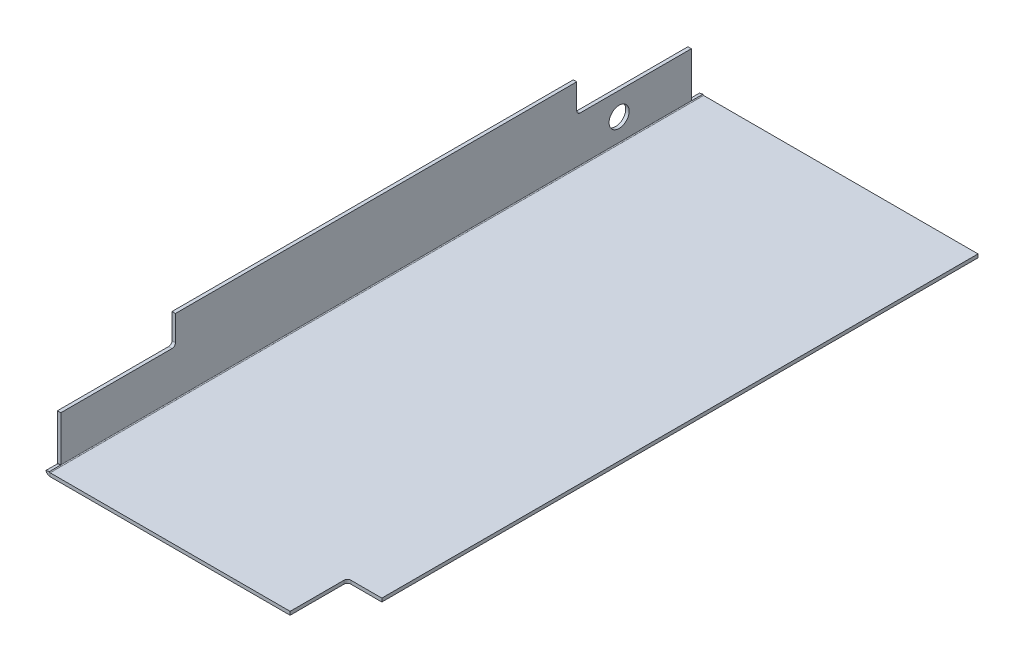
ISO-10303-21;
HEADER;
FILE_DESCRIPTION(('STEP AP214'),'2;1');
FILE_NAME('part.step','',(''),(''),'','','');
FILE_SCHEMA(('AUTOMOTIVE_DESIGN { 1 0 10303 214 1 1 1 1 }'));
ENDSEC;
DATA;
#1=APPLICATION_CONTEXT('core data for automotive mechanical design processes');
#2=APPLICATION_PROTOCOL_DEFINITION('international standard','automotive_design',2000,#1);
#3=PRODUCT_CONTEXT('',#1,'mechanical');
#4=PRODUCT('Part','Part','',(#3));
#5=PRODUCT_RELATED_PRODUCT_CATEGORY('part','',(#4));
#6=PRODUCT_DEFINITION_FORMATION('','',#4);
#7=PRODUCT_DEFINITION_CONTEXT('part definition',#1,'design');
#8=PRODUCT_DEFINITION('design','',#6,#7);
#9=PRODUCT_DEFINITION_SHAPE('','',#8);
#10=(LENGTH_UNIT() NAMED_UNIT(*) SI_UNIT(.MILLI.,.METRE.));
#11=(NAMED_UNIT(*) PLANE_ANGLE_UNIT() SI_UNIT($,.RADIAN.));
#12=(NAMED_UNIT(*) SI_UNIT($,.STERADIAN.) SOLID_ANGLE_UNIT());
#13=UNCERTAINTY_MEASURE_WITH_UNIT(LENGTH_MEASURE(1.E-05),#10,'distance_accuracy_value','');
#14=(GEOMETRIC_REPRESENTATION_CONTEXT(3) GLOBAL_UNCERTAINTY_ASSIGNED_CONTEXT((#13)) GLOBAL_UNIT_ASSIGNED_CONTEXT((#10,
#11,#12)) REPRESENTATION_CONTEXT('',''));
#15=CARTESIAN_POINT('',(0.,0.,0.));
#16=DIRECTION('',(0.,0.,1.));
#17=DIRECTION('',(1.,0.,0.));
#18=AXIS2_PLACEMENT_3D('',#15,#16,#17);
#19=CARTESIAN_POINT('',(-27.5195187862058,0.736600000000002,570.));
#20=DIRECTION('',(0.,0.,-1.));
#21=DIRECTION('',(-1.,0.,0.));
#22=AXIS2_PLACEMENT_3D('',#19,#20,#21);
#23=CYLINDRICAL_SURFACE('',#22,0.7366);
#24=DIRECTION('',(0.,0.,-1.));
#25=VECTOR('',#24,1.);
#26=CARTESIAN_POINT('',(-28.2561187862058,0.736600000000004,570.));
#27=LINE('',#26,#25);
#28=CARTESIAN_POINT('',(-28.2561187862058,0.736600000000002,560.));
#29=VERTEX_POINT('',#28);
#30=CARTESIAN_POINT('',(-28.2561187862058,0.736600000000018,10.));
#31=VERTEX_POINT('',#30);
#32=EDGE_CURVE('E357',#29,#31,#27,.T.);
#33=ORIENTED_EDGE('',*,*,#32,.F.);
#34=CARTESIAN_POINT('',(-27.5195187862058,0.736600000000002,560.));
#35=DIRECTION('',(0.,0.,-1.));
#36=DIRECTION('',(-1.,0.,0.));
#37=AXIS2_PLACEMENT_3D('',#34,#35,#36);
#38=CIRCLE('',#37,0.7366);
#39=CARTESIAN_POINT('',(-28.2416645875225,0.591393245196169,560.));
#40=VERTEX_POINT('',#39);
#41=EDGE_CURVE('E224',#29,#40,#38,.F.);
#42=ORIENTED_EDGE('',*,*,#41,.T.);
#43=DIRECTION('',(0.,0.,-1.));
#44=VECTOR('',#43,1.);
#45=CARTESIAN_POINT('',(-28.2416645875225,0.591393245196169,570.));
#46=LINE('',#45,#44);
#47=CARTESIAN_POINT('',(-28.2416645875225,0.591393245196169,570.));
#48=VERTEX_POINT('',#47);
#49=EDGE_CURVE('E227',#40,#48,#46,.F.);
#50=ORIENTED_EDGE('',*,*,#49,.T.);
#51=CARTESIAN_POINT('',(-27.5195187862058,0.736600000000002,570.));
#52=DIRECTION('',(0.,0.,-1.));
#53=DIRECTION('',(-1.,0.,0.));
#54=AXIS2_PLACEMENT_3D('',#51,#52,#53);
#55=CIRCLE('',#54,0.7366);
#56=CARTESIAN_POINT('',(-27.5195187862058,0.,570.));
#57=VERTEX_POINT('',#56);
#58=EDGE_CURVE('E333',#48,#57,#55,.F.);
#59=ORIENTED_EDGE('',*,*,#58,.T.);
#60=DIRECTION('',(0.,0.,-1.));
#61=VECTOR('',#60,1.);
#62=CARTESIAN_POINT('',(-27.5195187862058,0.,570.));
#63=LINE('',#62,#61);
#64=CARTESIAN_POINT('',(-27.5195187862058,0.,0.));
#65=VERTEX_POINT('',#64);
#66=EDGE_CURVE('E359',#57,#65,#63,.T.);
#67=ORIENTED_EDGE('',*,*,#66,.T.);
#68=CARTESIAN_POINT('',(-27.5195187862058,0.736600000000002,0.));
#69=DIRECTION('',(0.,0.,-1.));
#70=DIRECTION('',(-1.,0.,0.));
#71=AXIS2_PLACEMENT_3D('',#68,#69,#70);
#72=CIRCLE('',#71,0.7366);
#73=CARTESIAN_POINT('',(-28.2416645875225,0.591393245196169,0.));
#74=VERTEX_POINT('',#73);
#75=EDGE_CURVE('E346',#74,#65,#72,.F.);
#76=ORIENTED_EDGE('',*,*,#75,.F.);
#77=DIRECTION('',(0.,0.,-1.));
#78=VECTOR('',#77,1.);
#79=CARTESIAN_POINT('',(-28.2416645875225,0.591393245196162,570.));
#80=LINE('',#79,#78);
#81=CARTESIAN_POINT('',(-28.2416645875225,0.591393245196169,10.));
#82=VERTEX_POINT('',#81);
#83=EDGE_CURVE('E273',#74,#82,#80,.F.);
#84=ORIENTED_EDGE('',*,*,#83,.T.);
#85=CARTESIAN_POINT('',(-27.5195187862058,0.736600000000002,10.));
#86=DIRECTION('',(0.,0.,-1.));
#87=DIRECTION('',(-1.,0.,0.));
#88=AXIS2_PLACEMENT_3D('',#85,#86,#87);
#89=CIRCLE('',#88,0.7366);
#90=EDGE_CURVE('E276',#82,#31,#89,.T.);
#91=ORIENTED_EDGE('',*,*,#90,.T.);
#92=EDGE_LOOP('',(#33,#42,#50,#59,#67,#76,#84,#91));
#93=FACE_BOUND('',#92,.T.);
#94=ADVANCED_FACE('F41',(#93),#23,.F.);
#95=CARTESIAN_POINT('',(-28.2561187862058,65.,570.));
#96=DIRECTION('',(1.,0.,0.));
#97=DIRECTION('',(0.,1.,0.));
#98=AXIS2_PLACEMENT_3D('',#95,#96,#97);
#99=PLANE('',#98);
#100=CARTESIAN_POINT('',(-28.2561187862058,20.,73.0340409886785));
#101=DIRECTION('',(1.,0.,0.));
#102=DIRECTION('',(0.,1.,0.));
#103=AXIS2_PLACEMENT_3D('',#100,#101,#102);
#104=CIRCLE('',#103,8.75000000000001);
#105=CARTESIAN_POINT('',(-28.2561187862058,28.75,73.0340409886785));
#106=VERTEX_POINT('',#105);
#107=EDGE_CURVE('E211',#106,#106,#104,.T.);
#108=ORIENTED_EDGE('',*,*,#107,.F.);
#109=EDGE_LOOP('',(#108));
#110=FACE_BOUND('',#109,.T.);
#111=DIRECTION('',(0.,0.,-1.));
#112=VECTOR('',#111,1.);
#113=CARTESIAN_POINT('',(-28.2561187862058,65.,570.));
#114=LINE('',#113,#112);
#115=CARTESIAN_POINT('',(-28.2561187862058,65.,460.));
#116=VERTEX_POINT('',#115);
#117=CARTESIAN_POINT('',(-28.2561187862058,65.,110.));
#118=VERTEX_POINT('',#117);
#119=EDGE_CURVE('E355',#116,#118,#114,.T.);
#120=ORIENTED_EDGE('',*,*,#119,.F.);
#121=DIRECTION('',(0.,1.,0.));
#122=VECTOR('',#121,1.);
#123=CARTESIAN_POINT('',(-28.2561187862058,65.,460.));
#124=LINE('',#123,#122);
#125=CARTESIAN_POINT('',(-28.2561187862058,43.,460.));
#126=VERTEX_POINT('',#125);
#127=EDGE_CURVE('E241',#116,#126,#124,.F.);
#128=ORIENTED_EDGE('',*,*,#127,.T.);
#129=CARTESIAN_POINT('',(-28.2561187862058,43.,463.));
#130=DIRECTION('',(1.,0.,0.));
#131=DIRECTION('',(0.,1.,0.));
#132=AXIS2_PLACEMENT_3D('',#129,#130,#131);
#133=CIRCLE('',#132,3.);
#134=CARTESIAN_POINT('',(-28.2561187862058,40.,463.));
#135=VERTEX_POINT('',#134);
#136=EDGE_CURVE('E247',#126,#135,#133,.F.);
#137=ORIENTED_EDGE('',*,*,#136,.T.);
#138=DIRECTION('',(0.,0.,1.));
#139=VECTOR('',#138,1.);
#140=CARTESIAN_POINT('',(-28.2561187862058,40.,570.));
#141=LINE('',#140,#139);
#142=CARTESIAN_POINT('',(-28.2561187862058,40.,560.));
#143=VERTEX_POINT('',#142);
#144=EDGE_CURVE('E243',#135,#143,#141,.T.);
#145=ORIENTED_EDGE('',*,*,#144,.T.);
#146=DIRECTION('',(0.,1.,0.));
#147=VECTOR('',#146,1.);
#148=CARTESIAN_POINT('',(-28.2561187862058,65.,560.));
#149=LINE('',#148,#147);
#150=EDGE_CURVE('E238',#143,#29,#149,.F.);
#151=ORIENTED_EDGE('',*,*,#150,.T.);
#152=ORIENTED_EDGE('',*,*,#32,.T.);
#153=DIRECTION('',(0.,1.,0.));
#154=VECTOR('',#153,1.);
#155=CARTESIAN_POINT('',(-28.2561187862058,65.,10.));
#156=LINE('',#155,#154);
#157=CARTESIAN_POINT('',(-28.2561187862058,40.,10.));
#158=VERTEX_POINT('',#157);
#159=EDGE_CURVE('E291',#31,#158,#156,.T.);
#160=ORIENTED_EDGE('',*,*,#159,.T.);
#161=DIRECTION('',(0.,0.,1.));
#162=VECTOR('',#161,1.);
#163=CARTESIAN_POINT('',(-28.2561187862058,40.,570.));
#164=LINE('',#163,#162);
#165=CARTESIAN_POINT('',(-28.2561187862058,40.,107.));
#166=VERTEX_POINT('',#165);
#167=EDGE_CURVE('E294',#158,#166,#164,.T.);
#168=ORIENTED_EDGE('',*,*,#167,.T.);
#169=CARTESIAN_POINT('',(-28.2561187862058,43.,107.));
#170=DIRECTION('',(1.,0.,0.));
#171=DIRECTION('',(0.,1.,0.));
#172=AXIS2_PLACEMENT_3D('',#169,#170,#171);
#173=CIRCLE('',#172,3.);
#174=CARTESIAN_POINT('',(-28.2561187862058,43.,110.));
#175=VERTEX_POINT('',#174);
#176=EDGE_CURVE('E300',#166,#175,#173,.F.);
#177=ORIENTED_EDGE('',*,*,#176,.T.);
#178=DIRECTION('',(0.,1.,0.));
#179=VECTOR('',#178,1.);
#180=CARTESIAN_POINT('',(-28.2561187862058,65.,110.));
#181=LINE('',#180,#179);
#182=EDGE_CURVE('E296',#175,#118,#181,.T.);
#183=ORIENTED_EDGE('',*,*,#182,.T.);
#184=EDGE_LOOP('',(#120,#128,#137,#145,#151,#152,#160,#168,#177,#183));
#185=FACE_BOUND('',#184,.T.);
#186=ADVANCED_FACE('F422',(#110,#185),#99,.T.);
#187=CARTESIAN_POINT('',(-31.2561187862058,65.,570.));
#188=DIRECTION('',(0.,1.,0.));
#189=DIRECTION('',(0.,0.,1.));
#190=AXIS2_PLACEMENT_3D('',#187,#188,#189);
#191=PLANE('',#190);
#192=DIRECTION('',(0.,0.,-1.));
#193=VECTOR('',#192,1.);
#194=CARTESIAN_POINT('',(-31.2561187862058,65.,570.));
#195=LINE('',#194,#193);
#196=CARTESIAN_POINT('',(-31.2561187862058,65.,460.));
#197=VERTEX_POINT('',#196);
#198=CARTESIAN_POINT('',(-31.2561187862058,65.,110.));
#199=VERTEX_POINT('',#198);
#200=EDGE_CURVE('E353',#197,#199,#195,.T.);
#201=ORIENTED_EDGE('',*,*,#200,.F.);
#202=DIRECTION('',(-1.,0.,0.));
#203=VECTOR('',#202,1.);
#204=CARTESIAN_POINT('',(-31.2561187862058,65.,460.));
#205=LINE('',#204,#203);
#206=EDGE_CURVE('E267',#197,#116,#205,.F.);
#207=ORIENTED_EDGE('',*,*,#206,.T.);
#208=ORIENTED_EDGE('',*,*,#119,.T.);
#209=DIRECTION('',(-1.,0.,0.));
#210=VECTOR('',#209,1.);
#211=CARTESIAN_POINT('',(-31.2561187862058,65.,110.));
#212=LINE('',#211,#210);
#213=EDGE_CURVE('E315',#199,#118,#212,.F.);
#214=ORIENTED_EDGE('',*,*,#213,.F.);
#215=EDGE_LOOP('',(#201,#207,#208,#214));
#216=FACE_BOUND('',#215,.T.);
#217=ADVANCED_FACE('F449',(#216),#191,.T.);
#218=CARTESIAN_POINT('',(-31.2561187862058,65.,570.));
#219=DIRECTION('',(1.,0.,0.));
#220=DIRECTION('',(0.,1.,0.));
#221=AXIS2_PLACEMENT_3D('',#218,#219,#220);
#222=PLANE('',#221);
#223=CARTESIAN_POINT('',(-31.2561187862058,20.,73.0340409886785));
#224=DIRECTION('',(1.,0.,0.));
#225=DIRECTION('',(0.,1.,0.));
#226=AXIS2_PLACEMENT_3D('',#223,#224,#225);
#227=CIRCLE('',#226,8.75000000000001);
#228=CARTESIAN_POINT('',(-31.2561187862058,28.75,73.0340409886785));
#229=VERTEX_POINT('',#228);
#230=EDGE_CURVE('E207',#229,#229,#227,.F.);
#231=ORIENTED_EDGE('',*,*,#230,.F.);
#232=EDGE_LOOP('',(#231));
#233=FACE_BOUND('',#232,.T.);
#234=DIRECTION('',(0.,-1.,0.));
#235=VECTOR('',#234,1.);
#236=CARTESIAN_POINT('',(-31.2561187862058,65.,460.));
#237=LINE('',#236,#235);
#238=CARTESIAN_POINT('',(-31.2561187862058,43.,460.));
#239=VERTEX_POINT('',#238);
#240=EDGE_CURVE('E253',#197,#239,#237,.T.);
#241=ORIENTED_EDGE('',*,*,#240,.F.);
#242=ORIENTED_EDGE('',*,*,#200,.T.);
#243=DIRECTION('',(0.,1.,0.));
#244=VECTOR('',#243,1.);
#245=CARTESIAN_POINT('',(-31.2561187862058,43.,110.));
#246=LINE('',#245,#244);
#247=CARTESIAN_POINT('',(-31.2561187862058,43.,110.));
#248=VERTEX_POINT('',#247);
#249=EDGE_CURVE('E295',#248,#199,#246,.T.);
#250=ORIENTED_EDGE('',*,*,#249,.F.);
#251=CARTESIAN_POINT('',(-31.2561187862058,43.,107.));
#252=DIRECTION('',(1.,0.,0.));
#253=DIRECTION('',(0.,1.,0.));
#254=AXIS2_PLACEMENT_3D('',#251,#252,#253);
#255=CIRCLE('',#254,3.);
#256=CARTESIAN_POINT('',(-31.2561187862058,40.,107.));
#257=VERTEX_POINT('',#256);
#258=EDGE_CURVE('E308',#257,#248,#255,.F.);
#259=ORIENTED_EDGE('',*,*,#258,.F.);
#260=DIRECTION('',(0.,0.,1.));
#261=VECTOR('',#260,1.);
#262=CARTESIAN_POINT('',(-31.2561187862058,40.,9.99999999999999));
#263=LINE('',#262,#261);
#264=CARTESIAN_POINT('',(-31.2561187862058,40.,9.99999999999999));
#265=VERTEX_POINT('',#264);
#266=EDGE_CURVE('E306',#265,#257,#263,.T.);
#267=ORIENTED_EDGE('',*,*,#266,.F.);
#268=DIRECTION('',(0.,1.,0.));
#269=VECTOR('',#268,1.);
#270=CARTESIAN_POINT('',(-31.2561187862058,0.,10.));
#271=LINE('',#270,#269);
#272=CARTESIAN_POINT('',(-31.2561187862058,0.736600000000012,10.));
#273=VERTEX_POINT('',#272);
#274=EDGE_CURVE('E288',#273,#265,#271,.T.);
#275=ORIENTED_EDGE('',*,*,#274,.F.);
#276=DIRECTION('',(0.,0.,-1.));
#277=VECTOR('',#276,1.);
#278=CARTESIAN_POINT('',(-31.2561187862058,0.736600000000012,570.));
#279=LINE('',#278,#277);
#280=CARTESIAN_POINT('',(-31.2561187862058,0.736600000000002,560.));
#281=VERTEX_POINT('',#280);
#282=EDGE_CURVE('E351',#281,#273,#279,.T.);
#283=ORIENTED_EDGE('',*,*,#282,.F.);
#284=DIRECTION('',(0.,-1.,0.));
#285=VECTOR('',#284,1.);
#286=CARTESIAN_POINT('',(-31.2561187862058,40.,560.));
#287=LINE('',#286,#285);
#288=CARTESIAN_POINT('',(-31.2561187862058,40.,560.));
#289=VERTEX_POINT('',#288);
#290=EDGE_CURVE('E235',#289,#281,#287,.T.);
#291=ORIENTED_EDGE('',*,*,#290,.F.);
#292=DIRECTION('',(0.,0.,1.));
#293=VECTOR('',#292,1.);
#294=CARTESIAN_POINT('',(-31.2561187862058,40.,560.));
#295=LINE('',#294,#293);
#296=CARTESIAN_POINT('',(-31.2561187862058,40.,463.));
#297=VERTEX_POINT('',#296);
#298=EDGE_CURVE('E242',#297,#289,#295,.T.);
#299=ORIENTED_EDGE('',*,*,#298,.F.);
#300=CARTESIAN_POINT('',(-31.2561187862058,43.,463.));
#301=DIRECTION('',(1.,0.,0.));
#302=DIRECTION('',(0.,1.,0.));
#303=AXIS2_PLACEMENT_3D('',#300,#301,#302);
#304=CIRCLE('',#303,3.);
#305=EDGE_CURVE('E255',#239,#297,#304,.F.);
#306=ORIENTED_EDGE('',*,*,#305,.F.);
#307=EDGE_LOOP('',(#241,#242,#250,#259,#267,#275,#283,#291,#299,#306));
#308=FACE_BOUND('',#307,.T.);
#309=ADVANCED_FACE('F410',(#233,#308),#222,.F.);
#310=CARTESIAN_POINT('',(-27.5195187862058,0.736600000000002,570.));
#311=DIRECTION('',(0.,0.,-1.));
#312=DIRECTION('',(-1.,0.,0.));
#313=AXIS2_PLACEMENT_3D('',#310,#311,#312);
#314=CYLINDRICAL_SURFACE('',#313,3.7366);
#315=CARTESIAN_POINT('',(-27.5195187862058,0.736600000000002,560.));
#316=DIRECTION('',(0.,0.,-1.));
#317=DIRECTION('',(-1.,0.,0.));
#318=AXIS2_PLACEMENT_3D('',#315,#316,#317);
#319=CIRCLE('',#318,3.7366);
#320=CARTESIAN_POINT('',(-31.1827960074928,0.,560.));
#321=VERTEX_POINT('',#320);
#322=EDGE_CURVE('E201',#281,#321,#319,.F.);
#323=ORIENTED_EDGE('',*,*,#322,.F.);
#324=ORIENTED_EDGE('',*,*,#282,.T.);
#325=CARTESIAN_POINT('',(-27.5195187862058,0.736600000000002,10.));
#326=DIRECTION('',(0.,0.,1.));
#327=DIRECTION('',(0.,-1.,0.));
#328=AXIS2_PLACEMENT_3D('',#325,#326,#327);
#329=CIRCLE('',#328,3.7366);
#330=CARTESIAN_POINT('',(-31.1827960074928,0.,10.));
#331=VERTEX_POINT('',#330);
#332=EDGE_CURVE('E277',#331,#273,#329,.F.);
#333=ORIENTED_EDGE('',*,*,#332,.F.);
#334=DIRECTION('',(0.,0.,-1.));
#335=VECTOR('',#334,1.);
#336=CARTESIAN_POINT('',(-31.1827960074928,0.,570.));
#337=LINE('',#336,#335);
#338=CARTESIAN_POINT('',(-31.1827960074928,0.,0.));
#339=VERTEX_POINT('',#338);
#340=EDGE_CURVE('E270',#339,#331,#337,.F.);
#341=ORIENTED_EDGE('',*,*,#340,.F.);
#342=CARTESIAN_POINT('',(-27.5195187862058,0.736600000000002,0.));
#343=DIRECTION('',(0.,0.,1.));
#344=DIRECTION('',(1.,0.,0.));
#345=AXIS2_PLACEMENT_3D('',#342,#343,#344);
#346=CIRCLE('',#345,3.7366);
#347=CARTESIAN_POINT('',(-27.5195187862058,-3.,0.));
#348=VERTEX_POINT('',#347);
#349=EDGE_CURVE('E330',#339,#348,#346,.T.);
#350=ORIENTED_EDGE('',*,*,#349,.T.);
#351=DIRECTION('',(0.,0.,-1.));
#352=VECTOR('',#351,1.);
#353=CARTESIAN_POINT('',(-27.5195187862058,-3.,570.));
#354=LINE('',#353,#352);
#355=CARTESIAN_POINT('',(-27.5195187862058,-3.,570.));
#356=VERTEX_POINT('',#355);
#357=EDGE_CURVE('E337',#356,#348,#354,.T.);
#358=ORIENTED_EDGE('',*,*,#357,.F.);
#359=CARTESIAN_POINT('',(-27.5195187862058,0.736600000000002,570.));
#360=DIRECTION('',(0.,0.,1.));
#361=DIRECTION('',(1.,0.,0.));
#362=AXIS2_PLACEMENT_3D('',#359,#360,#361);
#363=CIRCLE('',#362,3.7366);
#364=CARTESIAN_POINT('',(-31.1827960074928,0.,570.));
#365=VERTEX_POINT('',#364);
#366=EDGE_CURVE('E335',#365,#356,#363,.T.);
#367=ORIENTED_EDGE('',*,*,#366,.F.);
#368=DIRECTION('',(0.,0.,-1.));
#369=VECTOR('',#368,1.);
#370=CARTESIAN_POINT('',(-31.1827960074928,0.,570.));
#371=LINE('',#370,#369);
#372=EDGE_CURVE('E64',#321,#365,#371,.F.);
#373=ORIENTED_EDGE('',*,*,#372,.F.);
#374=EDGE_LOOP('',(#323,#324,#333,#341,#350,#358,#367,#373));
#375=FACE_BOUND('',#374,.T.);
#376=ADVANCED_FACE('F392',(#375),#314,.T.);
#377=CARTESIAN_POINT('',(-27.5195187862058,0.,570.));
#378=DIRECTION('',(0.,0.,1.));
#379=DIRECTION('',(1.,0.,0.));
#380=AXIS2_PLACEMENT_3D('',#377,#378,#379);
#381=PLANE('',#380);
#382=ORIENTED_EDGE('',*,*,#58,.F.);
#383=DIRECTION('',(-0.98037713999009,-0.197131081732057,0.));
#384=VECTOR('',#383,1.);
#385=CARTESIAN_POINT('',(-31.1827960074928,0.,570.));
#386=LINE('',#385,#384);
#387=EDGE_CURVE('E233',#365,#48,#386,.F.);
#388=ORIENTED_EDGE('',*,*,#387,.F.);
#389=ORIENTED_EDGE('',*,*,#366,.T.);
#390=DIRECTION('',(0.,-1.,0.));
#391=VECTOR('',#390,1.);
#392=CARTESIAN_POINT('',(-27.5195187862058,0.,570.));
#393=LINE('',#392,#391);
#394=EDGE_CURVE('E11',#57,#356,#393,.T.);
#395=ORIENTED_EDGE('',*,*,#394,.F.);
#396=EDGE_LOOP('',(#382,#388,#389,#395));
#397=FACE_BOUND('',#396,.T.);
#398=ADVANCED_FACE('F43',(#397),#381,.T.);
#399=CARTESIAN_POINT('',(-28.2561187862058,0.736600000000004,0.));
#400=DIRECTION('',(0.,0.,-1.));
#401=DIRECTION('',(-1.,0.,0.));
#402=AXIS2_PLACEMENT_3D('',#399,#400,#401);
#403=PLANE('',#402);
#404=ORIENTED_EDGE('',*,*,#349,.F.);
#405=DIRECTION('',(-0.98037713999009,-0.197131081732057,0.));
#406=VECTOR('',#405,1.);
#407=CARTESIAN_POINT('',(-31.1827960074928,0.,0.));
#408=LINE('',#407,#406);
#409=EDGE_CURVE('E285',#339,#74,#408,.F.);
#410=ORIENTED_EDGE('',*,*,#409,.T.);
#411=ORIENTED_EDGE('',*,*,#75,.T.);
#412=DIRECTION('',(0.,1.,0.));
#413=VECTOR('',#412,1.);
#414=CARTESIAN_POINT('',(-27.5195187862058,-3.,0.));
#415=LINE('',#414,#413);
#416=EDGE_CURVE('E49',#348,#65,#415,.T.);
#417=ORIENTED_EDGE('',*,*,#416,.F.);
#418=EDGE_LOOP('',(#404,#410,#411,#417));
#419=FACE_BOUND('',#418,.T.);
#420=ADVANCED_FACE('F395',(#419),#403,.T.);
#421=CARTESIAN_POINT('',(-31.2561187862058,0.736600000000012,570.));
#422=DIRECTION('',(0.,0.,1.));
#423=DIRECTION('',(1.,0.,0.));
#424=AXIS2_PLACEMENT_3D('',#421,#422,#423);
#425=PLANE('',#424);
#426=DIRECTION('',(0.,1.,0.));
#427=VECTOR('',#426,1.);
#428=CARTESIAN_POINT('',(181.743881213794,-3.001,570.));
#429=LINE('',#428,#427);
#430=CARTESIAN_POINT('',(181.743881213794,-3.,570.));
#431=VERTEX_POINT('',#430);
#432=CARTESIAN_POINT('',(181.743881213794,0.,570.));
#433=VERTEX_POINT('',#432);
#434=EDGE_CURVE('E191',#431,#433,#429,.T.);
#435=ORIENTED_EDGE('',*,*,#434,.T.);
#436=DIRECTION('',(1.,0.,0.));
#437=VECTOR('',#436,1.);
#438=CARTESIAN_POINT('',(-28.2561187862058,0.,570.));
#439=LINE('',#438,#437);
#440=EDGE_CURVE('E329',#57,#433,#439,.T.);
#441=ORIENTED_EDGE('',*,*,#440,.F.);
#442=ORIENTED_EDGE('',*,*,#394,.T.);
#443=DIRECTION('',(1.,0.,0.));
#444=VECTOR('',#443,1.);
#445=CARTESIAN_POINT('',(-28.2561187862058,-3.,570.));
#446=LINE('',#445,#444);
#447=EDGE_CURVE('E327',#356,#431,#446,.T.);
#448=ORIENTED_EDGE('',*,*,#447,.T.);
#449=EDGE_LOOP('',(#435,#441,#442,#448));
#450=FACE_BOUND('',#449,.T.);
#451=ADVANCED_FACE('F436',(#450),#425,.T.);
#452=CARTESIAN_POINT('',(-28.2561187862058,-3.,570.));
#453=DIRECTION('',(0.,1.,0.));
#454=DIRECTION('',(0.,0.,1.));
#455=AXIS2_PLACEMENT_3D('',#452,#453,#454);
#456=PLANE('',#455);
#457=DIRECTION('',(0.,0.,-1.));
#458=VECTOR('',#457,1.);
#459=CARTESIAN_POINT('',(211.743881213794,-3.,570.));
#460=LINE('',#459,#458);
#461=CARTESIAN_POINT('',(211.743881213794,-3.,520.));
#462=VERTEX_POINT('',#461);
#463=CARTESIAN_POINT('',(211.743881213794,-3.,0.));
#464=VERTEX_POINT('',#463);
#465=EDGE_CURVE('E364',#462,#464,#460,.T.);
#466=ORIENTED_EDGE('',*,*,#465,.F.);
#467=DIRECTION('',(1.,0.,0.));
#468=VECTOR('',#467,1.);
#469=CARTESIAN_POINT('',(211.743881213794,-3.,520.));
#470=LINE('',#469,#468);
#471=CARTESIAN_POINT('',(184.743881213794,-3.,520.));
#472=VERTEX_POINT('',#471);
#473=EDGE_CURVE('E206',#472,#462,#470,.T.);
#474=ORIENTED_EDGE('',*,*,#473,.F.);
#475=CARTESIAN_POINT('',(184.743881213794,-3.,523.));
#476=DIRECTION('',(0.,1.,0.));
#477=DIRECTION('',(0.,0.,1.));
#478=AXIS2_PLACEMENT_3D('',#475,#476,#477);
#479=CIRCLE('',#478,2.99999999999999);
#480=CARTESIAN_POINT('',(181.743881213794,-3.,523.));
#481=VERTEX_POINT('',#480);
#482=EDGE_CURVE('E187',#481,#472,#479,.F.);
#483=ORIENTED_EDGE('',*,*,#482,.F.);
#484=DIRECTION('',(0.,0.,-1.));
#485=VECTOR('',#484,1.);
#486=CARTESIAN_POINT('',(181.743881213794,-3.,523.));
#487=LINE('',#486,#485);
#488=EDGE_CURVE('E195',#431,#481,#487,.T.);
#489=ORIENTED_EDGE('',*,*,#488,.F.);
#490=ORIENTED_EDGE('',*,*,#447,.F.);
#491=ORIENTED_EDGE('',*,*,#357,.T.);
#492=DIRECTION('',(1.,0.,0.));
#493=VECTOR('',#492,1.);
#494=CARTESIAN_POINT('',(-28.2561187862058,-3.,0.));
#495=LINE('',#494,#493);
#496=EDGE_CURVE('E324',#348,#464,#495,.T.);
#497=ORIENTED_EDGE('',*,*,#496,.T.);
#498=EDGE_LOOP('',(#466,#474,#483,#489,#490,#491,#497));
#499=FACE_BOUND('',#498,.T.);
#500=ADVANCED_FACE('F205',(#499),#456,.F.);
#501=CARTESIAN_POINT('',(211.743881213794,0.,570.));
#502=DIRECTION('',(1.,0.,0.));
#503=DIRECTION('',(0.,0.,-1.));
#504=AXIS2_PLACEMENT_3D('',#501,#502,#503);
#505=PLANE('',#504);
#506=DIRECTION('',(0.,1.,0.));
#507=VECTOR('',#506,1.);
#508=CARTESIAN_POINT('',(211.743881213794,-3.001,520.));
#509=LINE('',#508,#507);
#510=CARTESIAN_POINT('',(211.743881213794,0.,520.));
#511=VERTEX_POINT('',#510);
#512=EDGE_CURVE('E221',#462,#511,#509,.T.);
#513=ORIENTED_EDGE('',*,*,#512,.F.);
#514=ORIENTED_EDGE('',*,*,#465,.T.);
#515=DIRECTION('',(0.,-1.,0.));
#516=VECTOR('',#515,1.);
#517=CARTESIAN_POINT('',(211.743881213794,0.,0.));
#518=LINE('',#517,#516);
#519=CARTESIAN_POINT('',(211.743881213794,0.,0.));
#520=VERTEX_POINT('',#519);
#521=EDGE_CURVE('E340',#520,#464,#518,.T.);
#522=ORIENTED_EDGE('',*,*,#521,.F.);
#523=DIRECTION('',(0.,0.,-1.));
#524=VECTOR('',#523,1.);
#525=CARTESIAN_POINT('',(211.743881213794,0.,570.));
#526=LINE('',#525,#524);
#527=EDGE_CURVE('E362',#511,#520,#526,.T.);
#528=ORIENTED_EDGE('',*,*,#527,.F.);
#529=EDGE_LOOP('',(#513,#514,#522,#528));
#530=FACE_BOUND('',#529,.T.);
#531=ADVANCED_FACE('F387',(#530),#505,.T.);
#532=CARTESIAN_POINT('',(-28.2561187862058,0.,570.));
#533=DIRECTION('',(0.,1.,0.));
#534=DIRECTION('',(0.,0.,1.));
#535=AXIS2_PLACEMENT_3D('',#532,#533,#534);
#536=PLANE('',#535);
#537=DIRECTION('',(-1.,0.,0.));
#538=VECTOR('',#537,1.);
#539=CARTESIAN_POINT('',(211.743881213794,0.,520.));
#540=LINE('',#539,#538);
#541=CARTESIAN_POINT('',(184.743881213794,0.,520.));
#542=VERTEX_POINT('',#541);
#543=EDGE_CURVE('E192',#511,#542,#540,.T.);
#544=ORIENTED_EDGE('',*,*,#543,.F.);
#545=ORIENTED_EDGE('',*,*,#527,.T.);
#546=DIRECTION('',(1.,0.,0.));
#547=VECTOR('',#546,1.);
#548=CARTESIAN_POINT('',(-28.2561187862058,0.,0.));
#549=LINE('',#548,#547);
#550=EDGE_CURVE('E343',#65,#520,#549,.T.);
#551=ORIENTED_EDGE('',*,*,#550,.F.);
#552=ORIENTED_EDGE('',*,*,#66,.F.);
#553=ORIENTED_EDGE('',*,*,#440,.T.);
#554=DIRECTION('',(0.,0.,1.));
#555=VECTOR('',#554,1.);
#556=CARTESIAN_POINT('',(181.743881213794,0.,523.));
#557=LINE('',#556,#555);
#558=CARTESIAN_POINT('',(181.743881213794,0.,523.));
#559=VERTEX_POINT('',#558);
#560=EDGE_CURVE('E216',#559,#433,#557,.T.);
#561=ORIENTED_EDGE('',*,*,#560,.F.);
#562=CARTESIAN_POINT('',(184.743881213794,0.,523.));
#563=DIRECTION('',(0.,1.,0.));
#564=DIRECTION('',(0.,0.,-1.));
#565=AXIS2_PLACEMENT_3D('',#562,#563,#564);
#566=CIRCLE('',#565,2.99999999999999);
#567=EDGE_CURVE('E56',#542,#559,#566,.T.);
#568=ORIENTED_EDGE('',*,*,#567,.F.);
#569=EDGE_LOOP('',(#544,#545,#551,#552,#553,#561,#568));
#570=FACE_BOUND('',#569,.T.);
#571=ADVANCED_FACE('F382',(#570),#536,.T.);
#572=CARTESIAN_POINT('',(-27.5195187862058,0.736600000000002,0.));
#573=DIRECTION('',(0.,0.,-1.));
#574=DIRECTION('',(-1.,0.,0.));
#575=AXIS2_PLACEMENT_3D('',#572,#573,#574);
#576=PLANE('',#575);
#577=ORIENTED_EDGE('',*,*,#496,.F.);
#578=ORIENTED_EDGE('',*,*,#416,.T.);
#579=ORIENTED_EDGE('',*,*,#550,.T.);
#580=ORIENTED_EDGE('',*,*,#521,.T.);
#581=EDGE_LOOP('',(#577,#578,#579,#580));
#582=FACE_BOUND('',#581,.T.);
#583=ADVANCED_FACE('F369',(#582),#576,.T.);
#584=CARTESIAN_POINT('',(-31.2561187862058,43.,107.));
#585=DIRECTION('',(1.,0.,0.));
#586=DIRECTION('',(0.,1.,0.));
#587=AXIS2_PLACEMENT_3D('',#584,#585,#586);
#588=CYLINDRICAL_SURFACE('',#587,3.);
#589=DIRECTION('',(-1.,0.,0.));
#590=VECTOR('',#589,1.);
#591=CARTESIAN_POINT('',(-31.2561187862058,40.,107.));
#592=LINE('',#591,#590);
#593=EDGE_CURVE('E321',#257,#166,#592,.F.);
#594=ORIENTED_EDGE('',*,*,#593,.F.);
#595=ORIENTED_EDGE('',*,*,#258,.T.);
#596=DIRECTION('',(-1.,0.,0.));
#597=VECTOR('',#596,1.);
#598=CARTESIAN_POINT('',(-31.2561187862058,43.,110.));
#599=LINE('',#598,#597);
#600=EDGE_CURVE('E318',#248,#175,#599,.F.);
#601=ORIENTED_EDGE('',*,*,#600,.T.);
#602=ORIENTED_EDGE('',*,*,#176,.F.);
#603=EDGE_LOOP('',(#594,#595,#601,#602));
#604=FACE_BOUND('',#603,.T.);
#605=ADVANCED_FACE('F418',(#604),#588,.F.);
#606=CARTESIAN_POINT('',(-31.2561187862058,43.,110.));
#607=DIRECTION('',(0.,0.,-1.));
#608=DIRECTION('',(0.,1.,0.));
#609=AXIS2_PLACEMENT_3D('',#606,#607,#608);
#610=PLANE('',#609);
#611=ORIENTED_EDGE('',*,*,#600,.F.);
#612=ORIENTED_EDGE('',*,*,#249,.T.);
#613=ORIENTED_EDGE('',*,*,#213,.T.);
#614=ORIENTED_EDGE('',*,*,#182,.F.);
#615=EDGE_LOOP('',(#611,#612,#613,#614));
#616=FACE_BOUND('',#615,.T.);
#617=ADVANCED_FACE('F478',(#616),#610,.T.);
#618=CARTESIAN_POINT('',(-31.2561187862058,0.,10.));
#619=DIRECTION('',(0.,0.,-1.));
#620=DIRECTION('',(0.,1.,0.));
#621=AXIS2_PLACEMENT_3D('',#618,#619,#620);
#622=PLANE('',#621);
#623=DIRECTION('',(-1.,0.,0.));
#624=VECTOR('',#623,1.);
#625=CARTESIAN_POINT('',(-31.2561187862058,0.736600000000012,10.));
#626=LINE('',#625,#624);
#627=EDGE_CURVE('E312',#273,#31,#626,.F.);
#628=ORIENTED_EDGE('',*,*,#627,.F.);
#629=ORIENTED_EDGE('',*,*,#274,.T.);
#630=DIRECTION('',(-1.,0.,0.));
#631=VECTOR('',#630,1.);
#632=CARTESIAN_POINT('',(-31.2561187862058,40.,9.99999999999999));
#633=LINE('',#632,#631);
#634=EDGE_CURVE('E299',#265,#158,#633,.F.);
#635=ORIENTED_EDGE('',*,*,#634,.T.);
#636=ORIENTED_EDGE('',*,*,#159,.F.);
#637=EDGE_LOOP('',(#628,#629,#635,#636));
#638=FACE_BOUND('',#637,.T.);
#639=ADVANCED_FACE('F404',(#638),#622,.T.);
#640=CARTESIAN_POINT('',(-31.2561187862058,40.,9.99999999999999));
#641=DIRECTION('',(0.,1.,0.));
#642=DIRECTION('',(0.,0.,1.));
#643=AXIS2_PLACEMENT_3D('',#640,#641,#642);
#644=PLANE('',#643);
#645=ORIENTED_EDGE('',*,*,#266,.T.);
#646=ORIENTED_EDGE('',*,*,#593,.T.);
#647=ORIENTED_EDGE('',*,*,#167,.F.);
#648=ORIENTED_EDGE('',*,*,#634,.F.);
#649=EDGE_LOOP('',(#645,#646,#647,#648));
#650=FACE_BOUND('',#649,.T.);
#651=ADVANCED_FACE('F416',(#650),#644,.T.);
#652=CARTESIAN_POINT('',(-31.1827960074928,0.,5.));
#653=DIRECTION('',(-0.197131081732065,0.980377139990089,0.));
#654=DIRECTION('',(0.,0.,-1.));
#655=AXIS2_PLACEMENT_3D('',#652,#653,#654);
#656=PLANE('',#655);
#657=ORIENTED_EDGE('',*,*,#409,.F.);
#658=ORIENTED_EDGE('',*,*,#340,.T.);
#659=DIRECTION('',(-0.98037713999009,-0.197131081732057,0.));
#660=VECTOR('',#659,1.);
#661=CARTESIAN_POINT('',(-31.1827960074928,0.,10.));
#662=LINE('',#661,#660);
#663=EDGE_CURVE('E280',#331,#82,#662,.F.);
#664=ORIENTED_EDGE('',*,*,#663,.T.);
#665=ORIENTED_EDGE('',*,*,#83,.F.);
#666=EDGE_LOOP('',(#657,#658,#664,#665));
#667=FACE_BOUND('',#666,.T.);
#668=ADVANCED_FACE('F397',(#667),#656,.T.);
#669=CARTESIAN_POINT('',(-27.5195187862058,0.736600000000002,10.));
#670=DIRECTION('',(0.,0.,-1.));
#671=DIRECTION('',(0.,1.,0.));
#672=AXIS2_PLACEMENT_3D('',#669,#670,#671);
#673=PLANE('',#672);
#674=ORIENTED_EDGE('',*,*,#332,.T.);
#675=ORIENTED_EDGE('',*,*,#627,.T.);
#676=ORIENTED_EDGE('',*,*,#90,.F.);
#677=ORIENTED_EDGE('',*,*,#663,.F.);
#678=EDGE_LOOP('',(#674,#675,#676,#677));
#679=FACE_BOUND('',#678,.T.);
#680=ADVANCED_FACE('F399',(#679),#673,.T.);
#681=CARTESIAN_POINT('',(-31.2561187862058,65.,460.));
#682=DIRECTION('',(0.,0.,1.));
#683=DIRECTION('',(0.,-1.,0.));
#684=AXIS2_PLACEMENT_3D('',#681,#682,#683);
#685=PLANE('',#684);
#686=ORIENTED_EDGE('',*,*,#206,.F.);
#687=ORIENTED_EDGE('',*,*,#240,.T.);
#688=DIRECTION('',(-1.,0.,0.));
#689=VECTOR('',#688,1.);
#690=CARTESIAN_POINT('',(-31.2561187862058,43.,460.));
#691=LINE('',#690,#689);
#692=EDGE_CURVE('E264',#239,#126,#691,.F.);
#693=ORIENTED_EDGE('',*,*,#692,.T.);
#694=ORIENTED_EDGE('',*,*,#127,.F.);
#695=EDGE_LOOP('',(#686,#687,#693,#694));
#696=FACE_BOUND('',#695,.T.);
#697=ADVANCED_FACE('F511',(#696),#685,.T.);
#698=CARTESIAN_POINT('',(-31.2561187862058,43.,463.));
#699=DIRECTION('',(1.,0.,0.));
#700=DIRECTION('',(0.,1.,0.));
#701=AXIS2_PLACEMENT_3D('',#698,#699,#700);
#702=CYLINDRICAL_SURFACE('',#701,3.);
#703=ORIENTED_EDGE('',*,*,#692,.F.);
#704=ORIENTED_EDGE('',*,*,#305,.T.);
#705=DIRECTION('',(-1.,0.,0.));
#706=VECTOR('',#705,1.);
#707=CARTESIAN_POINT('',(-31.2561187862058,40.,463.));
#708=LINE('',#707,#706);
#709=EDGE_CURVE('E261',#297,#135,#708,.F.);
#710=ORIENTED_EDGE('',*,*,#709,.T.);
#711=ORIENTED_EDGE('',*,*,#136,.F.);
#712=EDGE_LOOP('',(#703,#704,#710,#711));
#713=FACE_BOUND('',#712,.T.);
#714=ADVANCED_FACE('F518',(#713),#702,.F.);
#715=CARTESIAN_POINT('',(-31.2561187862058,40.,560.));
#716=DIRECTION('',(0.,1.,0.));
#717=DIRECTION('',(0.,0.,1.));
#718=AXIS2_PLACEMENT_3D('',#715,#716,#717);
#719=PLANE('',#718);
#720=ORIENTED_EDGE('',*,*,#709,.F.);
#721=ORIENTED_EDGE('',*,*,#298,.T.);
#722=DIRECTION('',(-1.,0.,0.));
#723=VECTOR('',#722,1.);
#724=CARTESIAN_POINT('',(-31.2561187862058,40.,560.));
#725=LINE('',#724,#723);
#726=EDGE_CURVE('E258',#289,#143,#725,.F.);
#727=ORIENTED_EDGE('',*,*,#726,.T.);
#728=ORIENTED_EDGE('',*,*,#144,.F.);
#729=EDGE_LOOP('',(#720,#721,#727,#728));
#730=FACE_BOUND('',#729,.T.);
#731=ADVANCED_FACE('F429',(#730),#719,.T.);
#732=CARTESIAN_POINT('',(-31.2561187862058,40.,560.));
#733=DIRECTION('',(0.,0.,1.));
#734=DIRECTION('',(0.,-1.,0.));
#735=AXIS2_PLACEMENT_3D('',#732,#733,#734);
#736=PLANE('',#735);
#737=ORIENTED_EDGE('',*,*,#726,.F.);
#738=ORIENTED_EDGE('',*,*,#290,.T.);
#739=DIRECTION('',(-1.,0.,0.));
#740=VECTOR('',#739,1.);
#741=CARTESIAN_POINT('',(-31.2561187862058,0.736600000000002,560.));
#742=LINE('',#741,#740);
#743=EDGE_CURVE('E246',#281,#29,#742,.F.);
#744=ORIENTED_EDGE('',*,*,#743,.T.);
#745=ORIENTED_EDGE('',*,*,#150,.F.);
#746=EDGE_LOOP('',(#737,#738,#744,#745));
#747=FACE_BOUND('',#746,.T.);
#748=ADVANCED_FACE('F425',(#747),#736,.T.);
#749=CARTESIAN_POINT('',(-27.5195187862058,0.736600000000002,560.));
#750=DIRECTION('',(0.,0.,1.));
#751=DIRECTION('',(1.,0.,0.));
#752=AXIS2_PLACEMENT_3D('',#749,#750,#751);
#753=PLANE('',#752);
#754=ORIENTED_EDGE('',*,*,#743,.F.);
#755=ORIENTED_EDGE('',*,*,#322,.T.);
#756=DIRECTION('',(-0.98037713999009,-0.197131081732057,0.));
#757=VECTOR('',#756,1.);
#758=CARTESIAN_POINT('',(-31.1827960074928,0.,560.));
#759=LINE('',#758,#757);
#760=EDGE_CURVE('E230',#321,#40,#759,.F.);
#761=ORIENTED_EDGE('',*,*,#760,.T.);
#762=ORIENTED_EDGE('',*,*,#41,.F.);
#763=EDGE_LOOP('',(#754,#755,#761,#762));
#764=FACE_BOUND('',#763,.T.);
#765=ADVANCED_FACE('F433',(#764),#753,.T.);
#766=CARTESIAN_POINT('',(-31.1827960074928,0.,565.));
#767=DIRECTION('',(-0.197131081732057,0.98037713999009,0.));
#768=DIRECTION('',(0.,0.,-1.));
#769=AXIS2_PLACEMENT_3D('',#766,#767,#768);
#770=PLANE('',#769);
#771=ORIENTED_EDGE('',*,*,#372,.T.);
#772=ORIENTED_EDGE('',*,*,#387,.T.);
#773=ORIENTED_EDGE('',*,*,#49,.F.);
#774=ORIENTED_EDGE('',*,*,#760,.F.);
#775=EDGE_LOOP('',(#771,#772,#773,#774));
#776=FACE_BOUND('',#775,.T.);
#777=ADVANCED_FACE('F545',(#776),#770,.T.);
#778=CARTESIAN_POINT('',(184.743881213794,-3.001,523.));
#779=DIRECTION('',(0.,1.,0.));
#780=DIRECTION('',(0.,0.,1.));
#781=AXIS2_PLACEMENT_3D('',#778,#779,#780);
#782=CYLINDRICAL_SURFACE('',#781,2.99999999999999);
#783=ORIENTED_EDGE('',*,*,#482,.T.);
#784=DIRECTION('',(0.,1.,0.));
#785=VECTOR('',#784,1.);
#786=CARTESIAN_POINT('',(184.743881213794,-3.001,520.));
#787=LINE('',#786,#785);
#788=EDGE_CURVE('E202',#472,#542,#787,.T.);
#789=ORIENTED_EDGE('',*,*,#788,.T.);
#790=ORIENTED_EDGE('',*,*,#567,.T.);
#791=DIRECTION('',(0.,1.,0.));
#792=VECTOR('',#791,1.);
#793=CARTESIAN_POINT('',(181.743881213794,-3.001,523.));
#794=LINE('',#793,#792);
#795=EDGE_CURVE('E183',#481,#559,#794,.T.);
#796=ORIENTED_EDGE('',*,*,#795,.F.);
#797=EDGE_LOOP('',(#783,#789,#790,#796));
#798=FACE_BOUND('',#797,.T.);
#799=ADVANCED_FACE('F185',(#798),#782,.F.);
#800=CARTESIAN_POINT('',(211.743881213794,-3.001,520.));
#801=DIRECTION('',(0.,0.,-1.));
#802=DIRECTION('',(-1.,0.,0.));
#803=AXIS2_PLACEMENT_3D('',#800,#801,#802);
#804=PLANE('',#803);
#805=ORIENTED_EDGE('',*,*,#473,.T.);
#806=ORIENTED_EDGE('',*,*,#512,.T.);
#807=ORIENTED_EDGE('',*,*,#543,.T.);
#808=ORIENTED_EDGE('',*,*,#788,.F.);
#809=EDGE_LOOP('',(#805,#806,#807,#808));
#810=FACE_BOUND('',#809,.T.);
#811=ADVANCED_FACE('F557',(#810),#804,.F.);
#812=CARTESIAN_POINT('',(181.743881213794,-3.001,523.));
#813=DIRECTION('',(-1.,0.,0.));
#814=DIRECTION('',(0.,0.,1.));
#815=AXIS2_PLACEMENT_3D('',#812,#813,#814);
#816=PLANE('',#815);
#817=ORIENTED_EDGE('',*,*,#488,.T.);
#818=ORIENTED_EDGE('',*,*,#795,.T.);
#819=ORIENTED_EDGE('',*,*,#560,.T.);
#820=ORIENTED_EDGE('',*,*,#434,.F.);
#821=EDGE_LOOP('',(#817,#818,#819,#820));
#822=FACE_BOUND('',#821,.T.);
#823=ADVANCED_FACE('F196',(#822),#816,.F.);
#824=CARTESIAN_POINT('',(-31.2571187862058,20.,73.0340409886785));
#825=DIRECTION('',(1.,0.,0.));
#826=DIRECTION('',(0.,1.,0.));
#827=AXIS2_PLACEMENT_3D('',#824,#825,#826);
#828=CYLINDRICAL_SURFACE('',#827,8.75000000000001);
#829=ORIENTED_EDGE('',*,*,#107,.T.);
#830=EDGE_LOOP('',(#829));
#831=FACE_BOUND('',#830,.T.);
#832=ORIENTED_EDGE('',*,*,#230,.T.);
#833=EDGE_LOOP('',(#832));
#834=FACE_BOUND('',#833,.T.);
#835=ADVANCED_FACE('F571',(#831,#834),#828,.F.);
#836=CLOSED_SHELL('',(#94,#186,#217,#309,#376,#398,#420,#451,#500,#531,#571,#583,#605,#617,#639,
#651,#668,#680,#697,#714,#731,#748,#765,#777,#799,#811,#823,#835));
#837=MANIFOLD_SOLID_BREP('B2',#836);
#838=ADVANCED_BREP_SHAPE_REPRESENTATION('',(#18,#837),#14);
#839=SHAPE_DEFINITION_REPRESENTATION(#9,#838);
ENDSEC;
END-ISO-10303-21;
